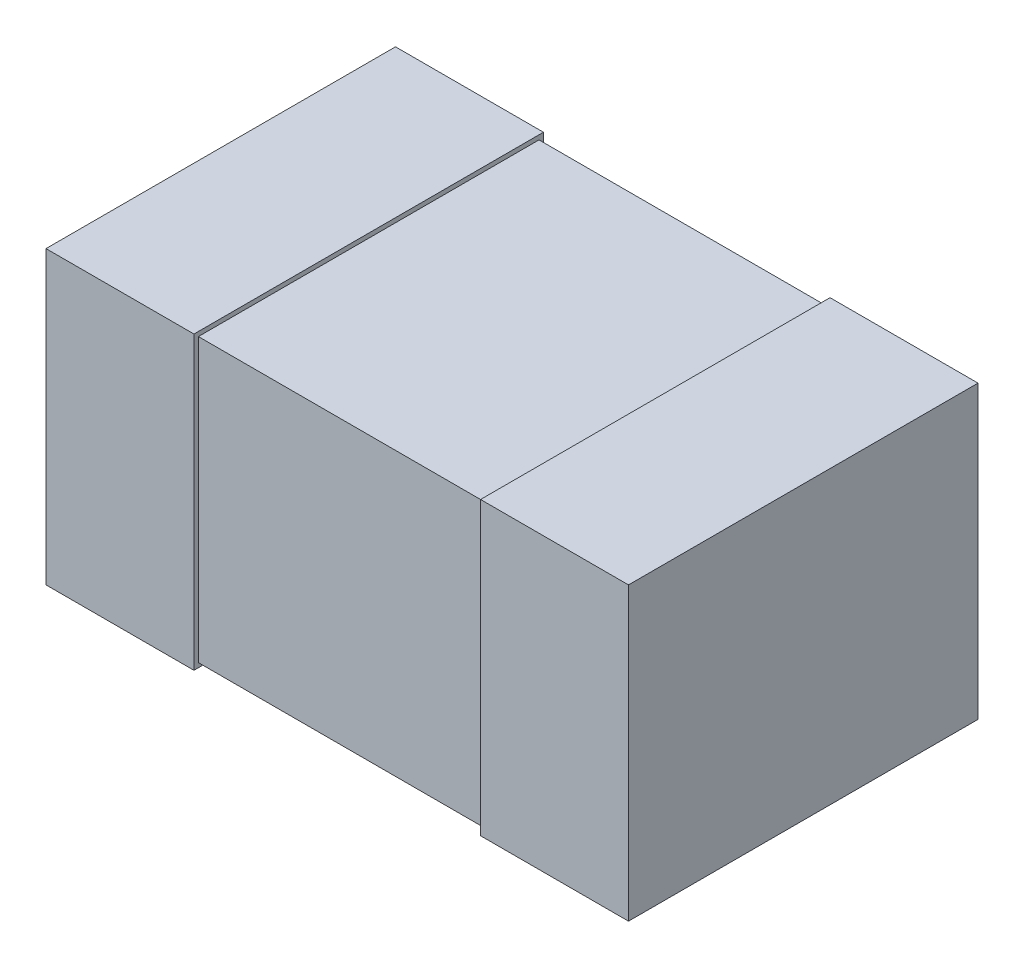
ISO-10303-21;
HEADER;
FILE_DESCRIPTION(('STEP AP214'),'2;1');
FILE_NAME('part.step','',(''),(''),'','','');
FILE_SCHEMA(('AUTOMOTIVE_DESIGN { 1 0 10303 214 1 1 1 1 }'));
ENDSEC;
DATA;
#1=APPLICATION_CONTEXT('core data for automotive mechanical design processes');
#2=APPLICATION_PROTOCOL_DEFINITION('international standard','automotive_design',2000,#1);
#3=PRODUCT_CONTEXT('',#1,'mechanical');
#4=PRODUCT('Part','Part','',(#3));
#5=PRODUCT_RELATED_PRODUCT_CATEGORY('part','',(#4));
#6=PRODUCT_DEFINITION_FORMATION('','',#4);
#7=PRODUCT_DEFINITION_CONTEXT('part definition',#1,'design');
#8=PRODUCT_DEFINITION('design','',#6,#7);
#9=PRODUCT_DEFINITION_SHAPE('','',#8);
#10=(LENGTH_UNIT() NAMED_UNIT(*) SI_UNIT(.MILLI.,.METRE.));
#11=(NAMED_UNIT(*) PLANE_ANGLE_UNIT() SI_UNIT($,.RADIAN.));
#12=(NAMED_UNIT(*) SI_UNIT($,.STERADIAN.) SOLID_ANGLE_UNIT());
#13=UNCERTAINTY_MEASURE_WITH_UNIT(LENGTH_MEASURE(1.E-05),#10,'distance_accuracy_value','');
#14=(GEOMETRIC_REPRESENTATION_CONTEXT(3) GLOBAL_UNCERTAINTY_ASSIGNED_CONTEXT((#13)) GLOBAL_UNIT_ASSIGNED_CONTEXT((#10,
#11,#12)) REPRESENTATION_CONTEXT('',''));
#15=CARTESIAN_POINT('',(0.,0.,0.));
#16=DIRECTION('',(0.,0.,1.));
#17=DIRECTION('',(1.,0.,0.));
#18=AXIS2_PLACEMENT_3D('',#15,#16,#17);
#19=CARTESIAN_POINT('',(0.5,-0.25,0.0762));
#20=DIRECTION('',(1.,0.,0.));
#21=DIRECTION('',(0.,1.,0.));
#22=AXIS2_PLACEMENT_3D('',#19,#20,#21);
#23=PLANE('',#22);
#24=DIRECTION('',(0.,0.,1.));
#25=VECTOR('',#24,1.);
#26=CARTESIAN_POINT('',(0.5,0.25,0.0762));
#27=LINE('',#26,#25);
#28=CARTESIAN_POINT('',(0.5,0.25,0.0762));
#29=VERTEX_POINT('',#28);
#30=CARTESIAN_POINT('',(0.5,0.25,0.6762));
#31=VERTEX_POINT('',#30);
#32=EDGE_CURVE('E144',#29,#31,#27,.T.);
#33=ORIENTED_EDGE('',*,*,#32,.T.);
#34=DIRECTION('',(0.,1.,0.));
#35=VECTOR('',#34,1.);
#36=CARTESIAN_POINT('',(0.5,-0.25,0.6762));
#37=LINE('',#36,#35);
#38=CARTESIAN_POINT('',(0.5,-0.25,0.6762));
#39=VERTEX_POINT('',#38);
#40=EDGE_CURVE('E205',#39,#31,#37,.T.);
#41=ORIENTED_EDGE('',*,*,#40,.F.);
#42=DIRECTION('',(0.,0.,1.));
#43=VECTOR('',#42,1.);
#44=CARTESIAN_POINT('',(0.5,-0.25,0.0762));
#45=LINE('',#44,#43);
#46=CARTESIAN_POINT('',(0.5,-0.25,0.0762));
#47=VERTEX_POINT('',#46);
#48=EDGE_CURVE('E11',#47,#39,#45,.T.);
#49=ORIENTED_EDGE('',*,*,#48,.F.);
#50=DIRECTION('',(0.,1.,0.));
#51=VECTOR('',#50,1.);
#52=CARTESIAN_POINT('',(0.5,-0.25,0.0762));
#53=LINE('',#52,#51);
#54=EDGE_CURVE('E22',#47,#29,#53,.T.);
#55=ORIENTED_EDGE('',*,*,#54,.T.);
#56=EDGE_LOOP('',(#33,#41,#49,#55));
#57=FACE_BOUND('',#56,.T.);
#58=ADVANCED_FACE('F18',(#57),#23,.T.);
#59=CARTESIAN_POINT('',(-0.5,0.25,0.0762));
#60=DIRECTION('',(-1.,0.,0.));
#61=DIRECTION('',(0.,0.,1.));
#62=AXIS2_PLACEMENT_3D('',#59,#60,#61);
#63=PLANE('',#62);
#64=DIRECTION('',(0.,0.,1.));
#65=VECTOR('',#64,1.);
#66=CARTESIAN_POINT('',(-0.5,-0.25,0.0762));
#67=LINE('',#66,#65);
#68=CARTESIAN_POINT('',(-0.5,-0.25,0.0762));
#69=VERTEX_POINT('',#68);
#70=CARTESIAN_POINT('',(-0.5,-0.25,0.6762));
#71=VERTEX_POINT('',#70);
#72=EDGE_CURVE('E29',#69,#71,#67,.T.);
#73=ORIENTED_EDGE('',*,*,#72,.T.);
#74=DIRECTION('',(0.,-1.,0.));
#75=VECTOR('',#74,1.);
#76=CARTESIAN_POINT('',(-0.5,0.25,0.6762));
#77=LINE('',#76,#75);
#78=CARTESIAN_POINT('',(-0.5,0.25,0.6762));
#79=VERTEX_POINT('',#78);
#80=EDGE_CURVE('E107',#79,#71,#77,.T.);
#81=ORIENTED_EDGE('',*,*,#80,.F.);
#82=DIRECTION('',(0.,0.,1.));
#83=VECTOR('',#82,1.);
#84=CARTESIAN_POINT('',(-0.5,0.25,0.0762));
#85=LINE('',#84,#83);
#86=CARTESIAN_POINT('',(-0.5,0.25,0.0762));
#87=VERTEX_POINT('',#86);
#88=EDGE_CURVE('E142',#87,#79,#85,.T.);
#89=ORIENTED_EDGE('',*,*,#88,.F.);
#90=DIRECTION('',(0.,-1.,0.));
#91=VECTOR('',#90,1.);
#92=CARTESIAN_POINT('',(-0.5,0.25,0.0762));
#93=LINE('',#92,#91);
#94=EDGE_CURVE('E156',#87,#69,#93,.T.);
#95=ORIENTED_EDGE('',*,*,#94,.T.);
#96=EDGE_LOOP('',(#73,#81,#89,#95));
#97=FACE_BOUND('',#96,.T.);
#98=ADVANCED_FACE('F281',(#97),#63,.T.);
#99=CARTESIAN_POINT('',(-0.5,-0.25,0.0762));
#100=DIRECTION('',(0.,-1.,0.));
#101=DIRECTION('',(0.,0.,-1.));
#102=AXIS2_PLACEMENT_3D('',#99,#100,#101);
#103=PLANE('',#102);
#104=DIRECTION('',(1.,0.,0.));
#105=VECTOR('',#104,1.);
#106=CARTESIAN_POINT('',(0.246,-0.25,0.0762));
#107=LINE('',#106,#105);
#108=CARTESIAN_POINT('',(0.246,-0.25,0.0762));
#109=VERTEX_POINT('',#108);
#110=EDGE_CURVE('E221',#109,#47,#107,.T.);
#111=ORIENTED_EDGE('',*,*,#110,.T.);
#112=ORIENTED_EDGE('',*,*,#48,.T.);
#113=DIRECTION('',(1.,0.,0.));
#114=VECTOR('',#113,1.);
#115=CARTESIAN_POINT('',(0.246,-0.25,0.6762));
#116=LINE('',#115,#114);
#117=CARTESIAN_POINT('',(0.246,-0.25,0.6762));
#118=VERTEX_POINT('',#117);
#119=EDGE_CURVE('E110',#118,#39,#116,.T.);
#120=ORIENTED_EDGE('',*,*,#119,.F.);
#121=DIRECTION('',(0.,0.,1.));
#122=VECTOR('',#121,1.);
#123=CARTESIAN_POINT('',(0.246,-0.25,0.0762));
#124=LINE('',#123,#122);
#125=EDGE_CURVE('E161',#109,#118,#124,.T.);
#126=ORIENTED_EDGE('',*,*,#125,.F.);
#127=EDGE_LOOP('',(#111,#112,#120,#126));
#128=FACE_BOUND('',#127,.T.);
#129=ADVANCED_FACE('F306',(#128),#103,.T.);
#130=CARTESIAN_POINT('',(-0.5,-0.25,0.0762));
#131=DIRECTION('',(0.,-1.,0.));
#132=DIRECTION('',(0.,0.,-1.));
#133=AXIS2_PLACEMENT_3D('',#130,#131,#132);
#134=PLANE('',#133);
#135=DIRECTION('',(1.,0.,0.));
#136=VECTOR('',#135,1.);
#137=CARTESIAN_POINT('',(-0.5,-0.25,0.6762));
#138=LINE('',#137,#136);
#139=CARTESIAN_POINT('',(-0.246,-0.25,0.6762));
#140=VERTEX_POINT('',#139);
#141=EDGE_CURVE('E100',#71,#140,#138,.T.);
#142=ORIENTED_EDGE('',*,*,#141,.F.);
#143=ORIENTED_EDGE('',*,*,#72,.F.);
#144=DIRECTION('',(1.,0.,0.));
#145=VECTOR('',#144,1.);
#146=CARTESIAN_POINT('',(-0.5,-0.25,0.0762));
#147=LINE('',#146,#145);
#148=CARTESIAN_POINT('',(-0.246,-0.25,0.0762));
#149=VERTEX_POINT('',#148);
#150=EDGE_CURVE('E116',#69,#149,#147,.T.);
#151=ORIENTED_EDGE('',*,*,#150,.T.);
#152=DIRECTION('',(0.,0.,1.));
#153=VECTOR('',#152,1.);
#154=CARTESIAN_POINT('',(-0.246,-0.25,0.0762));
#155=LINE('',#154,#153);
#156=EDGE_CURVE('E113',#149,#140,#155,.T.);
#157=ORIENTED_EDGE('',*,*,#156,.T.);
#158=EDGE_LOOP('',(#142,#143,#151,#157));
#159=FACE_BOUND('',#158,.T.);
#160=ADVANCED_FACE('F114',(#159),#134,.T.);
#161=CARTESIAN_POINT('',(0.,0.,0.6762));
#162=DIRECTION('',(0.,0.,1.));
#163=DIRECTION('',(1.,0.,0.));
#164=AXIS2_PLACEMENT_3D('',#161,#162,#163);
#165=PLANE('',#164);
#166=ORIENTED_EDGE('',*,*,#119,.T.);
#167=ORIENTED_EDGE('',*,*,#40,.T.);
#168=DIRECTION('',(-1.,0.,0.));
#169=VECTOR('',#168,1.);
#170=CARTESIAN_POINT('',(0.5,0.25,0.6762));
#171=LINE('',#170,#169);
#172=CARTESIAN_POINT('',(0.246,0.25,0.6762));
#173=VERTEX_POINT('',#172);
#174=EDGE_CURVE('E148',#31,#173,#171,.T.);
#175=ORIENTED_EDGE('',*,*,#174,.T.);
#176=DIRECTION('',(0.,1.,0.));
#177=VECTOR('',#176,1.);
#178=CARTESIAN_POINT('',(0.246,-0.25,0.6762));
#179=LINE('',#178,#177);
#180=EDGE_CURVE('E143',#118,#173,#179,.T.);
#181=ORIENTED_EDGE('',*,*,#180,.F.);
#182=EDGE_LOOP('',(#166,#167,#175,#181));
#183=FACE_BOUND('',#182,.T.);
#184=ADVANCED_FACE('F20',(#183),#165,.T.);
#185=CARTESIAN_POINT('',(0.,0.,0.6762));
#186=DIRECTION('',(0.,0.,1.));
#187=DIRECTION('',(1.,0.,0.));
#188=AXIS2_PLACEMENT_3D('',#185,#186,#187);
#189=PLANE('',#188);
#190=DIRECTION('',(-1.,0.,0.));
#191=VECTOR('',#190,1.);
#192=CARTESIAN_POINT('',(-0.246,0.25,0.6762));
#193=LINE('',#192,#191);
#194=CARTESIAN_POINT('',(-0.246,0.25,0.6762));
#195=VERTEX_POINT('',#194);
#196=EDGE_CURVE('E173',#195,#79,#193,.T.);
#197=ORIENTED_EDGE('',*,*,#196,.T.);
#198=ORIENTED_EDGE('',*,*,#80,.T.);
#199=ORIENTED_EDGE('',*,*,#141,.T.);
#200=DIRECTION('',(0.,1.,0.));
#201=VECTOR('',#200,1.);
#202=CARTESIAN_POINT('',(-0.246,-0.25,0.6762));
#203=LINE('',#202,#201);
#204=EDGE_CURVE('E105',#140,#195,#203,.T.);
#205=ORIENTED_EDGE('',*,*,#204,.T.);
#206=EDGE_LOOP('',(#197,#198,#199,#205));
#207=FACE_BOUND('',#206,.T.);
#208=ADVANCED_FACE('F103',(#207),#189,.T.);
#209=CARTESIAN_POINT('',(0.5,0.25,0.0762));
#210=DIRECTION('',(0.,1.,0.));
#211=DIRECTION('',(1.,0.,0.));
#212=AXIS2_PLACEMENT_3D('',#209,#210,#211);
#213=PLANE('',#212);
#214=ORIENTED_EDGE('',*,*,#174,.F.);
#215=ORIENTED_EDGE('',*,*,#32,.F.);
#216=DIRECTION('',(-1.,0.,0.));
#217=VECTOR('',#216,1.);
#218=CARTESIAN_POINT('',(0.5,0.25,0.0762));
#219=LINE('',#218,#217);
#220=CARTESIAN_POINT('',(0.246,0.25,0.0762));
#221=VERTEX_POINT('',#220);
#222=EDGE_CURVE('E183',#29,#221,#219,.T.);
#223=ORIENTED_EDGE('',*,*,#222,.T.);
#224=DIRECTION('',(0.,0.,1.));
#225=VECTOR('',#224,1.);
#226=CARTESIAN_POINT('',(0.246,0.25,0.0762));
#227=LINE('',#226,#225);
#228=EDGE_CURVE('E139',#221,#173,#227,.T.);
#229=ORIENTED_EDGE('',*,*,#228,.T.);
#230=EDGE_LOOP('',(#214,#215,#223,#229));
#231=FACE_BOUND('',#230,.T.);
#232=ADVANCED_FACE('F312',(#231),#213,.T.);
#233=CARTESIAN_POINT('',(0.5,0.25,0.0762));
#234=DIRECTION('',(0.,1.,0.));
#235=DIRECTION('',(1.,0.,0.));
#236=AXIS2_PLACEMENT_3D('',#233,#234,#235);
#237=PLANE('',#236);
#238=DIRECTION('',(-1.,0.,0.));
#239=VECTOR('',#238,1.);
#240=CARTESIAN_POINT('',(-0.246,0.25,0.0762));
#241=LINE('',#240,#239);
#242=CARTESIAN_POINT('',(-0.246,0.25,0.0762));
#243=VERTEX_POINT('',#242);
#244=EDGE_CURVE('E184',#243,#87,#241,.T.);
#245=ORIENTED_EDGE('',*,*,#244,.T.);
#246=ORIENTED_EDGE('',*,*,#88,.T.);
#247=ORIENTED_EDGE('',*,*,#196,.F.);
#248=DIRECTION('',(0.,0.,1.));
#249=VECTOR('',#248,1.);
#250=CARTESIAN_POINT('',(-0.246,0.25,0.0762));
#251=LINE('',#250,#249);
#252=EDGE_CURVE('E125',#243,#195,#251,.T.);
#253=ORIENTED_EDGE('',*,*,#252,.F.);
#254=EDGE_LOOP('',(#245,#246,#247,#253));
#255=FACE_BOUND('',#254,.T.);
#256=ADVANCED_FACE('F284',(#255),#237,.T.);
#257=CARTESIAN_POINT('',(0.246,-0.25,0.08382));
#258=DIRECTION('',(1.,0.,0.));
#259=DIRECTION('',(0.,1.,0.));
#260=AXIS2_PLACEMENT_3D('',#257,#258,#259);
#261=PLANE('',#260);
#262=DIRECTION('',(0.,0.,1.));
#263=VECTOR('',#262,1.);
#264=CARTESIAN_POINT('',(0.246,0.24238,0.08382));
#265=LINE('',#264,#263);
#266=CARTESIAN_POINT('',(0.246,0.24238,0.08382));
#267=VERTEX_POINT('',#266);
#268=CARTESIAN_POINT('',(0.246,0.24238,0.66858));
#269=VERTEX_POINT('',#268);
#270=EDGE_CURVE('E195',#267,#269,#265,.T.);
#271=ORIENTED_EDGE('',*,*,#270,.T.);
#272=DIRECTION('',(0.,-1.,0.));
#273=VECTOR('',#272,1.);
#274=CARTESIAN_POINT('',(0.246,0.24238,0.66858));
#275=LINE('',#274,#273);
#276=CARTESIAN_POINT('',(0.246,-0.24238,0.66858));
#277=VERTEX_POINT('',#276);
#278=EDGE_CURVE('E188',#269,#277,#275,.T.);
#279=ORIENTED_EDGE('',*,*,#278,.T.);
#280=DIRECTION('',(0.,0.,-1.));
#281=VECTOR('',#280,1.);
#282=CARTESIAN_POINT('',(0.246,-0.24238,0.66858));
#283=LINE('',#282,#281);
#284=CARTESIAN_POINT('',(0.246,-0.24238,0.08382));
#285=VERTEX_POINT('',#284);
#286=EDGE_CURVE('E165',#277,#285,#283,.T.);
#287=ORIENTED_EDGE('',*,*,#286,.T.);
#288=DIRECTION('',(0.,1.,0.));
#289=VECTOR('',#288,1.);
#290=CARTESIAN_POINT('',(0.246,-0.24238,0.08382));
#291=LINE('',#290,#289);
#292=EDGE_CURVE('E157',#285,#267,#291,.T.);
#293=ORIENTED_EDGE('',*,*,#292,.T.);
#294=EDGE_LOOP('',(#271,#279,#287,#293));
#295=FACE_BOUND('',#294,.T.);
#296=ORIENTED_EDGE('',*,*,#125,.T.);
#297=ORIENTED_EDGE('',*,*,#180,.T.);
#298=ORIENTED_EDGE('',*,*,#228,.F.);
#299=DIRECTION('',(0.,1.,0.));
#300=VECTOR('',#299,1.);
#301=CARTESIAN_POINT('',(0.246,-0.25,0.0762));
#302=LINE('',#301,#300);
#303=EDGE_CURVE('E134',#109,#221,#302,.T.);
#304=ORIENTED_EDGE('',*,*,#303,.F.);
#305=EDGE_LOOP('',(#296,#297,#298,#304));
#306=FACE_BOUND('',#305,.T.);
#307=ADVANCED_FACE('F258',(#295,#306),#261,.F.);
#308=CARTESIAN_POINT('',(-0.246,-0.25,0.08382));
#309=DIRECTION('',(0.,0.,1.));
#310=DIRECTION('',(1.,0.,0.));
#311=AXIS2_PLACEMENT_3D('',#308,#309,#310);
#312=PLANE('',#311);
#313=DIRECTION('',(0.,1.,0.));
#314=VECTOR('',#313,1.);
#315=CARTESIAN_POINT('',(-0.246,-0.24238,0.08382));
#316=LINE('',#315,#314);
#317=CARTESIAN_POINT('',(-0.246,-0.24238,0.08382));
#318=VERTEX_POINT('',#317);
#319=CARTESIAN_POINT('',(-0.246,0.24238,0.08382));
#320=VERTEX_POINT('',#319);
#321=EDGE_CURVE('E153',#318,#320,#316,.T.);
#322=ORIENTED_EDGE('',*,*,#321,.T.);
#323=DIRECTION('',(1.,0.,0.));
#324=VECTOR('',#323,1.);
#325=CARTESIAN_POINT('',(-0.246,0.24238,0.08382));
#326=LINE('',#325,#324);
#327=EDGE_CURVE('E162',#320,#267,#326,.T.);
#328=ORIENTED_EDGE('',*,*,#327,.T.);
#329=ORIENTED_EDGE('',*,*,#292,.F.);
#330=DIRECTION('',(1.,0.,0.));
#331=VECTOR('',#330,1.);
#332=CARTESIAN_POINT('',(-0.246,-0.24238,0.08382));
#333=LINE('',#332,#331);
#334=EDGE_CURVE('E138',#318,#285,#333,.T.);
#335=ORIENTED_EDGE('',*,*,#334,.F.);
#336=EDGE_LOOP('',(#322,#328,#329,#335));
#337=FACE_BOUND('',#336,.T.);
#338=ADVANCED_FACE('F311',(#337),#312,.F.);
#339=CARTESIAN_POINT('',(-0.246,0.24238,0.0762));
#340=DIRECTION('',(0.,-1.,0.));
#341=DIRECTION('',(0.,0.,-1.));
#342=AXIS2_PLACEMENT_3D('',#339,#340,#341);
#343=PLANE('',#342);
#344=DIRECTION('',(0.,0.,1.));
#345=VECTOR('',#344,1.);
#346=CARTESIAN_POINT('',(-0.246,0.24238,0.08382));
#347=LINE('',#346,#345);
#348=CARTESIAN_POINT('',(-0.246,0.24238,0.66858));
#349=VERTEX_POINT('',#348);
#350=EDGE_CURVE('E149',#320,#349,#347,.T.);
#351=ORIENTED_EDGE('',*,*,#350,.T.);
#352=DIRECTION('',(1.,0.,0.));
#353=VECTOR('',#352,1.);
#354=CARTESIAN_POINT('',(-0.246,0.24238,0.66858));
#355=LINE('',#354,#353);
#356=EDGE_CURVE('E192',#349,#269,#355,.T.);
#357=ORIENTED_EDGE('',*,*,#356,.T.);
#358=ORIENTED_EDGE('',*,*,#270,.F.);
#359=ORIENTED_EDGE('',*,*,#327,.F.);
#360=EDGE_LOOP('',(#351,#357,#358,#359));
#361=FACE_BOUND('',#360,.T.);
#362=ADVANCED_FACE('F318',(#361),#343,.F.);
#363=CARTESIAN_POINT('',(-0.246,0.25,0.66858));
#364=DIRECTION('',(0.,0.,-1.));
#365=DIRECTION('',(0.,-1.,0.));
#366=AXIS2_PLACEMENT_3D('',#363,#364,#365);
#367=PLANE('',#366);
#368=DIRECTION('',(0.,-1.,0.));
#369=VECTOR('',#368,1.);
#370=CARTESIAN_POINT('',(-0.246,0.24238,0.66858));
#371=LINE('',#370,#369);
#372=CARTESIAN_POINT('',(-0.246,-0.24238,0.66858));
#373=VERTEX_POINT('',#372);
#374=EDGE_CURVE('E121',#349,#373,#371,.T.);
#375=ORIENTED_EDGE('',*,*,#374,.T.);
#376=DIRECTION('',(1.,0.,0.));
#377=VECTOR('',#376,1.);
#378=CARTESIAN_POINT('',(-0.246,-0.24238,0.66858));
#379=LINE('',#378,#377);
#380=EDGE_CURVE('E169',#373,#277,#379,.T.);
#381=ORIENTED_EDGE('',*,*,#380,.T.);
#382=ORIENTED_EDGE('',*,*,#278,.F.);
#383=ORIENTED_EDGE('',*,*,#356,.F.);
#384=EDGE_LOOP('',(#375,#381,#382,#383));
#385=FACE_BOUND('',#384,.T.);
#386=ADVANCED_FACE('F243',(#385),#367,.F.);
#387=CARTESIAN_POINT('',(-0.246,-0.24238,0.6762));
#388=DIRECTION('',(0.,1.,0.));
#389=DIRECTION('',(1.,0.,0.));
#390=AXIS2_PLACEMENT_3D('',#387,#388,#389);
#391=PLANE('',#390);
#392=DIRECTION('',(0.,0.,-1.));
#393=VECTOR('',#392,1.);
#394=CARTESIAN_POINT('',(-0.246,-0.24238,0.66858));
#395=LINE('',#394,#393);
#396=EDGE_CURVE('E179',#373,#318,#395,.T.);
#397=ORIENTED_EDGE('',*,*,#396,.T.);
#398=ORIENTED_EDGE('',*,*,#334,.T.);
#399=ORIENTED_EDGE('',*,*,#286,.F.);
#400=ORIENTED_EDGE('',*,*,#380,.F.);
#401=EDGE_LOOP('',(#397,#398,#399,#400));
#402=FACE_BOUND('',#401,.T.);
#403=ADVANCED_FACE('F254',(#402),#391,.F.);
#404=CARTESIAN_POINT('',(-0.246,-0.25,0.0762));
#405=DIRECTION('',(-1.,0.,0.));
#406=DIRECTION('',(0.,0.,1.));
#407=AXIS2_PLACEMENT_3D('',#404,#405,#406);
#408=PLANE('',#407);
#409=ORIENTED_EDGE('',*,*,#374,.F.);
#410=ORIENTED_EDGE('',*,*,#350,.F.);
#411=ORIENTED_EDGE('',*,*,#321,.F.);
#412=ORIENTED_EDGE('',*,*,#396,.F.);
#413=EDGE_LOOP('',(#409,#410,#411,#412));
#414=FACE_BOUND('',#413,.T.);
#415=ORIENTED_EDGE('',*,*,#252,.T.);
#416=ORIENTED_EDGE('',*,*,#204,.F.);
#417=ORIENTED_EDGE('',*,*,#156,.F.);
#418=DIRECTION('',(0.,1.,0.));
#419=VECTOR('',#418,1.);
#420=CARTESIAN_POINT('',(-0.246,-0.25,0.0762));
#421=LINE('',#420,#419);
#422=EDGE_CURVE('E180',#149,#243,#421,.T.);
#423=ORIENTED_EDGE('',*,*,#422,.T.);
#424=EDGE_LOOP('',(#415,#416,#417,#423));
#425=FACE_BOUND('',#424,.T.);
#426=ADVANCED_FACE('F123',(#414,#425),#408,.F.);
#427=CARTESIAN_POINT('',(0.,0.,0.0762));
#428=DIRECTION('',(0.,0.,1.));
#429=DIRECTION('',(1.,0.,0.));
#430=AXIS2_PLACEMENT_3D('',#427,#428,#429);
#431=PLANE('',#430);
#432=ORIENTED_EDGE('',*,*,#222,.F.);
#433=ORIENTED_EDGE('',*,*,#54,.F.);
#434=ORIENTED_EDGE('',*,*,#110,.F.);
#435=ORIENTED_EDGE('',*,*,#303,.T.);
#436=EDGE_LOOP('',(#432,#433,#434,#435));
#437=FACE_BOUND('',#436,.T.);
#438=ADVANCED_FACE('F288',(#437),#431,.F.);
#439=CARTESIAN_POINT('',(0.,0.,0.0762));
#440=DIRECTION('',(0.,0.,1.));
#441=DIRECTION('',(1.,0.,0.));
#442=AXIS2_PLACEMENT_3D('',#439,#440,#441);
#443=PLANE('',#442);
#444=ORIENTED_EDGE('',*,*,#150,.F.);
#445=ORIENTED_EDGE('',*,*,#94,.F.);
#446=ORIENTED_EDGE('',*,*,#244,.F.);
#447=ORIENTED_EDGE('',*,*,#422,.F.);
#448=EDGE_LOOP('',(#444,#445,#446,#447));
#449=FACE_BOUND('',#448,.T.);
#450=ADVANCED_FACE('F286',(#449),#443,.F.);
#451=CLOSED_SHELL('',(#58,#98,#129,#160,#184,#208,#232,#256,#307,#338,#362,#386,#403,#426,#438,#450));
#452=MANIFOLD_SOLID_BREP('B1',#451);
#453=ADVANCED_BREP_SHAPE_REPRESENTATION('',(#18,#452),#14);
#454=SHAPE_DEFINITION_REPRESENTATION(#9,#453);
ENDSEC;
END-ISO-10303-21;
